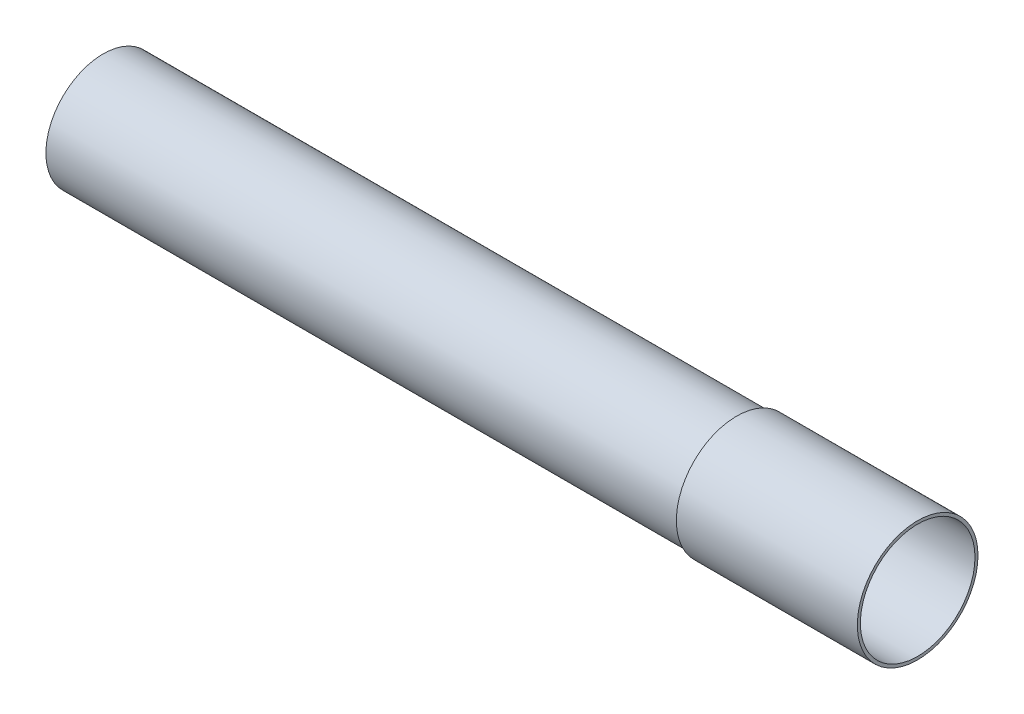
ISO-10303-21;
HEADER;
FILE_DESCRIPTION(('STEP AP214'),'2;1');
FILE_NAME('part.step','',(''),(''),'','','');
FILE_SCHEMA(('AUTOMOTIVE_DESIGN { 1 0 10303 214 1 1 1 1 }'));
ENDSEC;
DATA;
#1=APPLICATION_CONTEXT('core data for automotive mechanical design processes');
#2=APPLICATION_PROTOCOL_DEFINITION('international standard','automotive_design',2000,#1);
#3=PRODUCT_CONTEXT('',#1,'mechanical');
#4=PRODUCT('Part','Part','',(#3));
#5=PRODUCT_RELATED_PRODUCT_CATEGORY('part','',(#4));
#6=PRODUCT_DEFINITION_FORMATION('','',#4);
#7=PRODUCT_DEFINITION_CONTEXT('part definition',#1,'design');
#8=PRODUCT_DEFINITION('design','',#6,#7);
#9=PRODUCT_DEFINITION_SHAPE('','',#8);
#10=(LENGTH_UNIT() NAMED_UNIT(*) SI_UNIT(.MILLI.,.METRE.));
#11=(NAMED_UNIT(*) PLANE_ANGLE_UNIT() SI_UNIT($,.RADIAN.));
#12=(NAMED_UNIT(*) SI_UNIT($,.STERADIAN.) SOLID_ANGLE_UNIT());
#13=UNCERTAINTY_MEASURE_WITH_UNIT(LENGTH_MEASURE(1.E-05),#10,'distance_accuracy_value','');
#14=(GEOMETRIC_REPRESENTATION_CONTEXT(3) GLOBAL_UNCERTAINTY_ASSIGNED_CONTEXT((#13)) GLOBAL_UNIT_ASSIGNED_CONTEXT((#10,
#11,#12)) REPRESENTATION_CONTEXT('',''));
#15=CARTESIAN_POINT('',(0.,0.,0.));
#16=DIRECTION('',(0.,0.,1.));
#17=DIRECTION('',(1.,0.,0.));
#18=AXIS2_PLACEMENT_3D('',#15,#16,#17);
#19=CARTESIAN_POINT('',(240.,0.,0.));
#20=DIRECTION('',(-1.,0.,0.));
#21=DIRECTION('',(0.,0.,1.));
#22=AXIS2_PLACEMENT_3D('',#19,#20,#21);
#23=CYLINDRICAL_SURFACE('',#22,19.);
#24=CARTESIAN_POINT('',(0.,0.,0.));
#25=DIRECTION('',(1.,0.,0.));
#26=DIRECTION('',(0.,0.,-1.));
#27=AXIS2_PLACEMENT_3D('',#24,#25,#26);
#28=CIRCLE('',#27,19.);
#29=CARTESIAN_POINT('',(0.,0.,-19.));
#30=VERTEX_POINT('',#29);
#31=EDGE_CURVE('E37',#30,#30,#28,.T.);
#32=ORIENTED_EDGE('',*,*,#31,.T.);
#33=EDGE_LOOP('',(#32));
#34=FACE_BOUND('',#33,.T.);
#35=CARTESIAN_POINT('',(210.,0.,0.));
#36=DIRECTION('',(1.,0.,0.));
#37=DIRECTION('',(0.,0.,-1.));
#38=AXIS2_PLACEMENT_3D('',#35,#36,#37);
#39=CIRCLE('',#38,19.);
#40=CARTESIAN_POINT('',(210.,0.,-19.));
#41=VERTEX_POINT('',#40);
#42=EDGE_CURVE('E10',#41,#41,#39,.T.);
#43=ORIENTED_EDGE('',*,*,#42,.F.);
#44=EDGE_LOOP('',(#43));
#45=FACE_BOUND('',#44,.T.);
#46=ADVANCED_FACE('F31',(#34,#45),#23,.T.);
#47=CARTESIAN_POINT('',(240.,0.,0.));
#48=DIRECTION('',(1.,0.,0.));
#49=DIRECTION('',(0.,0.,-1.));
#50=AXIS2_PLACEMENT_3D('',#47,#48,#49);
#51=PLANE('',#50);
#52=CARTESIAN_POINT('',(240.,0.,0.));
#53=DIRECTION('',(1.,0.,0.));
#54=DIRECTION('',(0.,0.,-1.));
#55=AXIS2_PLACEMENT_3D('',#52,#53,#54);
#56=CIRCLE('',#55,19.);
#57=CARTESIAN_POINT('',(240.,0.,-19.));
#58=VERTEX_POINT('',#57);
#59=EDGE_CURVE('E49',#58,#58,#56,.F.);
#60=ORIENTED_EDGE('',*,*,#59,.F.);
#61=EDGE_LOOP('',(#60));
#62=FACE_BOUND('',#61,.T.);
#63=CARTESIAN_POINT('',(240.,0.,0.));
#64=DIRECTION('',(1.,0.,0.));
#65=DIRECTION('',(0.,0.,-1.));
#66=AXIS2_PLACEMENT_3D('',#63,#64,#65);
#67=CIRCLE('',#66,17.);
#68=CARTESIAN_POINT('',(240.,0.,-17.));
#69=VERTEX_POINT('',#68);
#70=EDGE_CURVE('E41',#69,#69,#67,.T.);
#71=ORIENTED_EDGE('',*,*,#70,.F.);
#72=EDGE_LOOP('',(#71));
#73=FACE_BOUND('',#72,.T.);
#74=ADVANCED_FACE('F84',(#62,#73),#51,.T.);
#75=CARTESIAN_POINT('',(0.,0.,0.));
#76=DIRECTION('',(1.,0.,0.));
#77=DIRECTION('',(0.,0.,-1.));
#78=AXIS2_PLACEMENT_3D('',#75,#76,#77);
#79=PLANE('',#78);
#80=ORIENTED_EDGE('',*,*,#31,.F.);
#81=EDGE_LOOP('',(#80));
#82=FACE_BOUND('',#81,.T.);
#83=CARTESIAN_POINT('',(0.,0.,0.));
#84=DIRECTION('',(1.,0.,0.));
#85=DIRECTION('',(0.,0.,-1.));
#86=AXIS2_PLACEMENT_3D('',#83,#84,#85);
#87=CIRCLE('',#86,17.);
#88=CARTESIAN_POINT('',(0.,0.,-17.));
#89=VERTEX_POINT('',#88);
#90=EDGE_CURVE('E45',#89,#89,#87,.T.);
#91=ORIENTED_EDGE('',*,*,#90,.T.);
#92=EDGE_LOOP('',(#91));
#93=FACE_BOUND('',#92,.T.);
#94=ADVANCED_FACE('F79',(#82,#93),#79,.F.);
#95=CARTESIAN_POINT('',(240.,0.,0.));
#96=DIRECTION('',(-1.,0.,0.));
#97=DIRECTION('',(0.,0.,1.));
#98=AXIS2_PLACEMENT_3D('',#95,#96,#97);
#99=CYLINDRICAL_SURFACE('',#98,17.);
#100=ORIENTED_EDGE('',*,*,#70,.T.);
#101=EDGE_LOOP('',(#100));
#102=FACE_BOUND('',#101,.T.);
#103=ORIENTED_EDGE('',*,*,#90,.F.);
#104=EDGE_LOOP('',(#103));
#105=FACE_BOUND('',#104,.T.);
#106=ADVANCED_FACE('F68',(#102,#105),#99,.F.);
#107=CARTESIAN_POINT('',(270.,0.,0.));
#108=DIRECTION('',(1.,0.,0.));
#109=DIRECTION('',(0.,0.,-1.));
#110=AXIS2_PLACEMENT_3D('',#107,#108,#109);
#111=PLANE('',#110);
#112=CARTESIAN_POINT('',(270.,0.,0.));
#113=DIRECTION('',(1.,0.,0.));
#114=DIRECTION('',(0.,0.,-1.));
#115=AXIS2_PLACEMENT_3D('',#112,#113,#114);
#116=CIRCLE('',#115,20.);
#117=CARTESIAN_POINT('',(270.,0.,-20.));
#118=VERTEX_POINT('',#117);
#119=EDGE_CURVE('E53',#118,#118,#116,.T.);
#120=ORIENTED_EDGE('',*,*,#119,.T.);
#121=EDGE_LOOP('',(#120));
#122=FACE_BOUND('',#121,.T.);
#123=CARTESIAN_POINT('',(270.,0.,0.));
#124=DIRECTION('',(1.,0.,0.));
#125=DIRECTION('',(0.,0.,-1.));
#126=AXIS2_PLACEMENT_3D('',#123,#124,#125);
#127=CIRCLE('',#126,19.);
#128=CARTESIAN_POINT('',(270.,0.,-19.));
#129=VERTEX_POINT('',#128);
#130=EDGE_CURVE('E57',#129,#129,#127,.T.);
#131=ORIENTED_EDGE('',*,*,#130,.F.);
#132=EDGE_LOOP('',(#131));
#133=FACE_BOUND('',#132,.T.);
#134=ADVANCED_FACE('F65',(#122,#133),#111,.T.);
#135=CARTESIAN_POINT('',(210.,0.,0.));
#136=DIRECTION('',(1.,0.,0.));
#137=DIRECTION('',(0.,0.,-1.));
#138=AXIS2_PLACEMENT_3D('',#135,#136,#137);
#139=PLANE('',#138);
#140=CARTESIAN_POINT('',(210.,0.,0.));
#141=DIRECTION('',(1.,0.,0.));
#142=DIRECTION('',(0.,0.,-1.));
#143=AXIS2_PLACEMENT_3D('',#140,#141,#142);
#144=CIRCLE('',#143,20.);
#145=CARTESIAN_POINT('',(210.,0.,-20.));
#146=VERTEX_POINT('',#145);
#147=EDGE_CURVE('E54',#146,#146,#144,.T.);
#148=ORIENTED_EDGE('',*,*,#147,.F.);
#149=EDGE_LOOP('',(#148));
#150=FACE_BOUND('',#149,.T.);
#151=ORIENTED_EDGE('',*,*,#42,.T.);
#152=EDGE_LOOP('',(#151));
#153=FACE_BOUND('',#152,.T.);
#154=ADVANCED_FACE('F67',(#150,#153),#139,.F.);
#155=CARTESIAN_POINT('',(270.,0.,0.));
#156=DIRECTION('',(-1.,0.,0.));
#157=DIRECTION('',(0.,0.,1.));
#158=AXIS2_PLACEMENT_3D('',#155,#156,#157);
#159=CYLINDRICAL_SURFACE('',#158,20.);
#160=ORIENTED_EDGE('',*,*,#119,.F.);
#161=EDGE_LOOP('',(#160));
#162=FACE_BOUND('',#161,.T.);
#163=ORIENTED_EDGE('',*,*,#147,.T.);
#164=EDGE_LOOP('',(#163));
#165=FACE_BOUND('',#164,.T.);
#166=ADVANCED_FACE('F75',(#162,#165),#159,.T.);
#167=CARTESIAN_POINT('',(270.,0.,0.));
#168=DIRECTION('',(-1.,0.,0.));
#169=DIRECTION('',(0.,0.,1.));
#170=AXIS2_PLACEMENT_3D('',#167,#168,#169);
#171=CYLINDRICAL_SURFACE('',#170,19.);
#172=ORIENTED_EDGE('',*,*,#59,.T.);
#173=EDGE_LOOP('',(#172));
#174=FACE_BOUND('',#173,.T.);
#175=ORIENTED_EDGE('',*,*,#130,.T.);
#176=EDGE_LOOP('',(#175));
#177=FACE_BOUND('',#176,.T.);
#178=ADVANCED_FACE('F63',(#174,#177),#171,.F.);
#179=CLOSED_SHELL('',(#46,#74,#94,#106,#134,#154,#166,#178));
#180=MANIFOLD_SOLID_BREP('B2',#179);
#181=ADVANCED_BREP_SHAPE_REPRESENTATION('',(#18,#180),#14);
#182=SHAPE_DEFINITION_REPRESENTATION(#9,#181);
ENDSEC;
END-ISO-10303-21;
